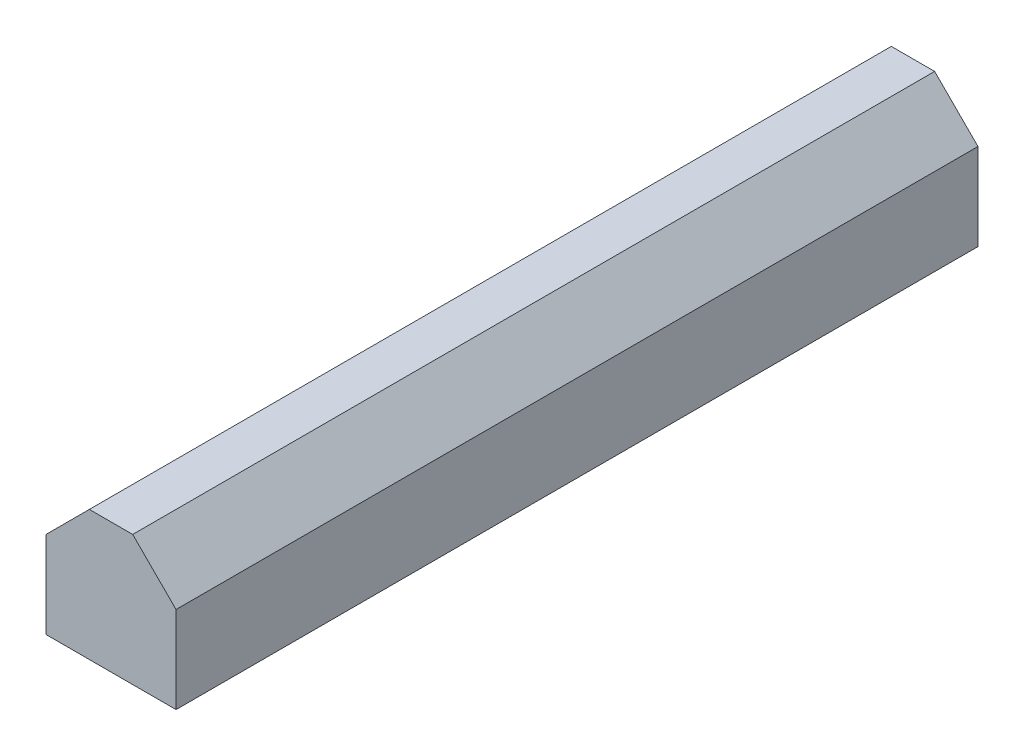
ISO-10303-21;
HEADER;
FILE_DESCRIPTION(('STEP AP214'),'2;1');
FILE_NAME('part.step','',(''),(''),'','','');
FILE_SCHEMA(('AUTOMOTIVE_DESIGN { 1 0 10303 214 1 1 1 1 }'));
ENDSEC;
DATA;
#1=APPLICATION_CONTEXT('core data for automotive mechanical design processes');
#2=APPLICATION_PROTOCOL_DEFINITION('international standard','automotive_design',2000,#1);
#3=PRODUCT_CONTEXT('',#1,'mechanical');
#4=PRODUCT('Part','Part','',(#3));
#5=PRODUCT_RELATED_PRODUCT_CATEGORY('part','',(#4));
#6=PRODUCT_DEFINITION_FORMATION('','',#4);
#7=PRODUCT_DEFINITION_CONTEXT('part definition',#1,'design');
#8=PRODUCT_DEFINITION('design','',#6,#7);
#9=PRODUCT_DEFINITION_SHAPE('','',#8);
#10=(LENGTH_UNIT() NAMED_UNIT(*) SI_UNIT(.MILLI.,.METRE.));
#11=(NAMED_UNIT(*) PLANE_ANGLE_UNIT() SI_UNIT($,.RADIAN.));
#12=(NAMED_UNIT(*) SI_UNIT($,.STERADIAN.) SOLID_ANGLE_UNIT());
#13=UNCERTAINTY_MEASURE_WITH_UNIT(LENGTH_MEASURE(1.E-05),#10,'distance_accuracy_value','');
#14=(GEOMETRIC_REPRESENTATION_CONTEXT(3) GLOBAL_UNCERTAINTY_ASSIGNED_CONTEXT((#13)) GLOBAL_UNIT_ASSIGNED_CONTEXT((#10,
#11,#12)) REPRESENTATION_CONTEXT('',''));
#15=CARTESIAN_POINT('',(0.,0.,0.));
#16=DIRECTION('',(0.,0.,1.));
#17=DIRECTION('',(1.,0.,0.));
#18=AXIS2_PLACEMENT_3D('',#15,#16,#17);
#19=CARTESIAN_POINT('',(3.,4.5,-45.4852813742386));
#20=DIRECTION('',(1.,0.,0.));
#21=DIRECTION('',(0.,0.,-1.));
#22=AXIS2_PLACEMENT_3D('',#19,#20,#21);
#23=PLANE('',#22);
#24=DIRECTION('',(0.,-1.,0.));
#25=VECTOR('',#24,1.);
#26=CARTESIAN_POINT('',(3.,4.5,-37.));
#27=LINE('',#26,#25);
#28=CARTESIAN_POINT('',(3.,8.5,-37.));
#29=VERTEX_POINT('',#28);
#30=CARTESIAN_POINT('',(3.,4.5,-37.));
#31=VERTEX_POINT('',#30);
#32=EDGE_CURVE('E44',#29,#31,#27,.T.);
#33=ORIENTED_EDGE('',*,*,#32,.F.);
#34=DIRECTION('',(0.,0.,1.));
#35=VECTOR('',#34,1.);
#36=CARTESIAN_POINT('',(3.,8.5,-45.4852813742386));
#37=LINE('',#36,#35);
#38=CARTESIAN_POINT('',(3.,8.5,0.));
#39=VERTEX_POINT('',#38);
#40=EDGE_CURVE('E83',#29,#39,#37,.T.);
#41=ORIENTED_EDGE('',*,*,#40,.T.);
#42=DIRECTION('',(0.,1.,0.));
#43=VECTOR('',#42,1.);
#44=CARTESIAN_POINT('',(3.,4.5,0.));
#45=LINE('',#44,#43);
#46=CARTESIAN_POINT('',(3.,4.5,0.));
#47=VERTEX_POINT('',#46);
#48=EDGE_CURVE('E87',#47,#39,#45,.T.);
#49=ORIENTED_EDGE('',*,*,#48,.F.);
#50=DIRECTION('',(0.,0.,1.));
#51=VECTOR('',#50,1.);
#52=CARTESIAN_POINT('',(3.,4.5,-45.4852813742386));
#53=LINE('',#52,#51);
#54=EDGE_CURVE('E117',#31,#47,#53,.T.);
#55=ORIENTED_EDGE('',*,*,#54,.F.);
#56=EDGE_LOOP('',(#33,#41,#49,#55));
#57=FACE_BOUND('',#56,.T.);
#58=ADVANCED_FACE('F36',(#57),#23,.T.);
#59=CARTESIAN_POINT('',(3.,4.5,-45.4852813742386));
#60=DIRECTION('',(0.,-1.,0.));
#61=DIRECTION('',(0.,0.,-1.));
#62=AXIS2_PLACEMENT_3D('',#59,#60,#61);
#63=PLANE('',#62);
#64=DIRECTION('',(-1.,0.,0.));
#65=VECTOR('',#64,1.);
#66=CARTESIAN_POINT('',(3.,4.5,-37.));
#67=LINE('',#66,#65);
#68=CARTESIAN_POINT('',(-3.,4.5,-37.));
#69=VERTEX_POINT('',#68);
#70=EDGE_CURVE('E139',#31,#69,#67,.T.);
#71=ORIENTED_EDGE('',*,*,#70,.F.);
#72=ORIENTED_EDGE('',*,*,#54,.T.);
#73=DIRECTION('',(1.,0.,0.));
#74=VECTOR('',#73,1.);
#75=CARTESIAN_POINT('',(3.,4.5,0.));
#76=LINE('',#75,#74);
#77=CARTESIAN_POINT('',(-3.,4.5,0.));
#78=VERTEX_POINT('',#77);
#79=EDGE_CURVE('E93',#78,#47,#76,.T.);
#80=ORIENTED_EDGE('',*,*,#79,.F.);
#81=DIRECTION('',(0.,0.,1.));
#82=VECTOR('',#81,1.);
#83=CARTESIAN_POINT('',(-3.,4.5,-45.4852813742386));
#84=LINE('',#83,#82);
#85=EDGE_CURVE('E120',#69,#78,#84,.T.);
#86=ORIENTED_EDGE('',*,*,#85,.F.);
#87=EDGE_LOOP('',(#71,#72,#80,#86));
#88=FACE_BOUND('',#87,.T.);
#89=ADVANCED_FACE('F138',(#88),#63,.T.);
#90=CARTESIAN_POINT('',(-3.,4.5,-45.4852813742386));
#91=DIRECTION('',(-1.,0.,0.));
#92=DIRECTION('',(0.,0.,1.));
#93=AXIS2_PLACEMENT_3D('',#90,#91,#92);
#94=PLANE('',#93);
#95=DIRECTION('',(0.,1.,0.));
#96=VECTOR('',#95,1.);
#97=CARTESIAN_POINT('',(-3.,4.5,-37.));
#98=LINE('',#97,#96);
#99=CARTESIAN_POINT('',(-3.,8.5,-37.));
#100=VERTEX_POINT('',#99);
#101=EDGE_CURVE('E142',#69,#100,#98,.T.);
#102=ORIENTED_EDGE('',*,*,#101,.F.);
#103=ORIENTED_EDGE('',*,*,#85,.T.);
#104=DIRECTION('',(0.,-1.,0.));
#105=VECTOR('',#104,1.);
#106=CARTESIAN_POINT('',(-3.,4.5,0.));
#107=LINE('',#106,#105);
#108=CARTESIAN_POINT('',(-3.,8.5,0.));
#109=VERTEX_POINT('',#108);
#110=EDGE_CURVE('E114',#109,#78,#107,.T.);
#111=ORIENTED_EDGE('',*,*,#110,.F.);
#112=DIRECTION('',(0.,0.,1.));
#113=VECTOR('',#112,1.);
#114=CARTESIAN_POINT('',(-3.,8.5,-45.4852813742386));
#115=LINE('',#114,#113);
#116=EDGE_CURVE('E122',#100,#109,#115,.T.);
#117=ORIENTED_EDGE('',*,*,#116,.F.);
#118=EDGE_LOOP('',(#102,#103,#111,#117));
#119=FACE_BOUND('',#118,.T.);
#120=ADVANCED_FACE('F146',(#119),#94,.T.);
#121=CARTESIAN_POINT('',(-1.,10.5,-45.4852813742386));
#122=DIRECTION('',(-0.707106781186547,0.707106781186547,0.));
#123=DIRECTION('',(-0.707106781186547,-0.707106781186547,0.));
#124=AXIS2_PLACEMENT_3D('',#121,#122,#123);
#125=PLANE('',#124);
#126=DIRECTION('',(0.707106781186547,0.707106781186547,0.));
#127=VECTOR('',#126,1.);
#128=CARTESIAN_POINT('',(-1.,10.5,-37.));
#129=LINE('',#128,#127);
#130=CARTESIAN_POINT('',(-1.,10.5,-37.));
#131=VERTEX_POINT('',#130);
#132=EDGE_CURVE('E51',#100,#131,#129,.T.);
#133=ORIENTED_EDGE('',*,*,#132,.F.);
#134=ORIENTED_EDGE('',*,*,#116,.T.);
#135=DIRECTION('',(-0.707106781186548,-0.707106781186548,0.));
#136=VECTOR('',#135,1.);
#137=CARTESIAN_POINT('',(-1.,10.5,0.));
#138=LINE('',#137,#136);
#139=CARTESIAN_POINT('',(-1.,10.5,0.));
#140=VERTEX_POINT('',#139);
#141=EDGE_CURVE('E111',#140,#109,#138,.T.);
#142=ORIENTED_EDGE('',*,*,#141,.F.);
#143=DIRECTION('',(0.,0.,1.));
#144=VECTOR('',#143,1.);
#145=CARTESIAN_POINT('',(-1.,10.5,-45.4852813742386));
#146=LINE('',#145,#144);
#147=EDGE_CURVE('E124',#131,#140,#146,.T.);
#148=ORIENTED_EDGE('',*,*,#147,.F.);
#149=EDGE_LOOP('',(#133,#134,#142,#148));
#150=FACE_BOUND('',#149,.T.);
#151=ADVANCED_FACE('F131',(#150),#125,.T.);
#152=CARTESIAN_POINT('',(1.,10.5,-45.4852813742386));
#153=DIRECTION('',(0.,1.,0.));
#154=DIRECTION('',(0.,0.,1.));
#155=AXIS2_PLACEMENT_3D('',#152,#153,#154);
#156=PLANE('',#155);
#157=DIRECTION('',(1.,0.,0.));
#158=VECTOR('',#157,1.);
#159=CARTESIAN_POINT('',(1.,10.5,-37.));
#160=LINE('',#159,#158);
#161=CARTESIAN_POINT('',(1.,10.5,-37.));
#162=VERTEX_POINT('',#161);
#163=EDGE_CURVE('E119',#131,#162,#160,.T.);
#164=ORIENTED_EDGE('',*,*,#163,.F.);
#165=ORIENTED_EDGE('',*,*,#147,.T.);
#166=DIRECTION('',(-1.,0.,0.));
#167=VECTOR('',#166,1.);
#168=CARTESIAN_POINT('',(1.,10.5,0.));
#169=LINE('',#168,#167);
#170=CARTESIAN_POINT('',(1.,10.5,0.));
#171=VERTEX_POINT('',#170);
#172=EDGE_CURVE('E101',#171,#140,#169,.T.);
#173=ORIENTED_EDGE('',*,*,#172,.F.);
#174=DIRECTION('',(0.,0.,1.));
#175=VECTOR('',#174,1.);
#176=CARTESIAN_POINT('',(1.,10.5,-45.4852813742386));
#177=LINE('',#176,#175);
#178=EDGE_CURVE('E92',#162,#171,#177,.T.);
#179=ORIENTED_EDGE('',*,*,#178,.F.);
#180=EDGE_LOOP('',(#164,#165,#173,#179));
#181=FACE_BOUND('',#180,.T.);
#182=ADVANCED_FACE('F129',(#181),#156,.T.);
#183=CARTESIAN_POINT('',(3.,8.5,-45.4852813742386));
#184=DIRECTION('',(0.707106781186547,0.707106781186547,0.));
#185=DIRECTION('',(-0.707106781186547,0.707106781186547,0.));
#186=AXIS2_PLACEMENT_3D('',#183,#184,#185);
#187=PLANE('',#186);
#188=DIRECTION('',(0.707106781186547,-0.707106781186547,0.));
#189=VECTOR('',#188,1.);
#190=CARTESIAN_POINT('',(3.,8.5,-37.));
#191=LINE('',#190,#189);
#192=EDGE_CURVE('E11',#162,#29,#191,.T.);
#193=ORIENTED_EDGE('',*,*,#192,.F.);
#194=ORIENTED_EDGE('',*,*,#178,.T.);
#195=DIRECTION('',(-0.707106781186548,0.707106781186548,0.));
#196=VECTOR('',#195,1.);
#197=CARTESIAN_POINT('',(3.,8.5,0.));
#198=LINE('',#197,#196);
#199=EDGE_CURVE('E95',#39,#171,#198,.T.);
#200=ORIENTED_EDGE('',*,*,#199,.F.);
#201=ORIENTED_EDGE('',*,*,#40,.F.);
#202=EDGE_LOOP('',(#193,#194,#200,#201));
#203=FACE_BOUND('',#202,.T.);
#204=ADVANCED_FACE('F96',(#203),#187,.T.);
#205=CARTESIAN_POINT('',(0.,0.,0.));
#206=DIRECTION('',(0.,0.,1.));
#207=DIRECTION('',(1.,0.,0.));
#208=AXIS2_PLACEMENT_3D('',#205,#206,#207);
#209=PLANE('',#208);
#210=ORIENTED_EDGE('',*,*,#48,.T.);
#211=ORIENTED_EDGE('',*,*,#199,.T.);
#212=ORIENTED_EDGE('',*,*,#172,.T.);
#213=ORIENTED_EDGE('',*,*,#141,.T.);
#214=ORIENTED_EDGE('',*,*,#110,.T.);
#215=ORIENTED_EDGE('',*,*,#79,.T.);
#216=EDGE_LOOP('',(#210,#211,#212,#213,#214,#215));
#217=FACE_BOUND('',#216,.T.);
#218=ADVANCED_FACE('F103',(#217),#209,.T.);
#219=CARTESIAN_POINT('',(0.,25.,-37.));
#220=DIRECTION('',(0.,0.,1.));
#221=DIRECTION('',(1.,0.,0.));
#222=AXIS2_PLACEMENT_3D('',#219,#220,#221);
#223=PLANE('',#222);
#224=ORIENTED_EDGE('',*,*,#32,.T.);
#225=ORIENTED_EDGE('',*,*,#70,.T.);
#226=ORIENTED_EDGE('',*,*,#101,.T.);
#227=ORIENTED_EDGE('',*,*,#132,.T.);
#228=ORIENTED_EDGE('',*,*,#163,.T.);
#229=ORIENTED_EDGE('',*,*,#192,.T.);
#230=EDGE_LOOP('',(#224,#225,#226,#227,#228,#229));
#231=FACE_BOUND('',#230,.T.);
#232=ADVANCED_FACE('F140',(#231),#223,.F.);
#233=CLOSED_SHELL('',(#58,#89,#120,#151,#182,#204,#218,#232));
#234=MANIFOLD_SOLID_BREP('B2',#233);
#235=ADVANCED_BREP_SHAPE_REPRESENTATION('',(#18,#234),#14);
#236=SHAPE_DEFINITION_REPRESENTATION(#9,#235);
ENDSEC;
END-ISO-10303-21;
